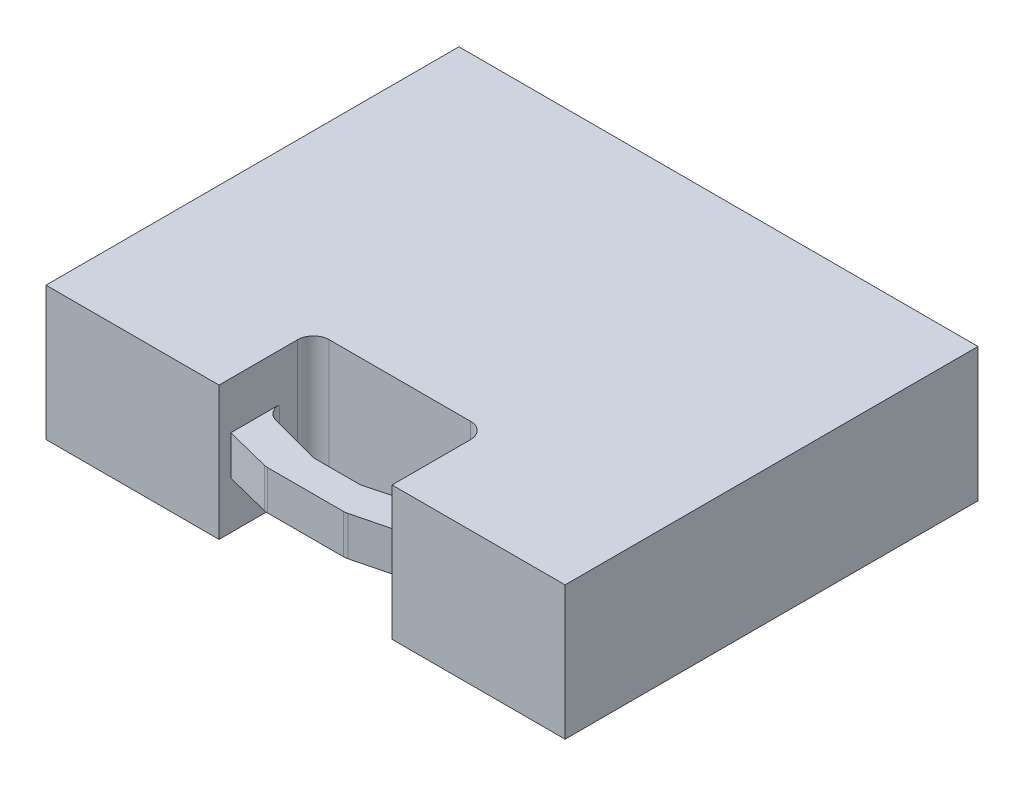
ISO-10303-21;
HEADER;
FILE_DESCRIPTION(('STEP AP214'),'2;1');
FILE_NAME('part.step','',(''),(''),'','','');
FILE_SCHEMA(('AUTOMOTIVE_DESIGN { 1 0 10303 214 1 1 1 1 }'));
ENDSEC;
DATA;
#1=APPLICATION_CONTEXT('core data for automotive mechanical design processes');
#2=APPLICATION_PROTOCOL_DEFINITION('international standard','automotive_design',2000,#1);
#3=PRODUCT_CONTEXT('',#1,'mechanical');
#4=PRODUCT('Part','Part','',(#3));
#5=PRODUCT_RELATED_PRODUCT_CATEGORY('part','',(#4));
#6=PRODUCT_DEFINITION_FORMATION('','',#4);
#7=PRODUCT_DEFINITION_CONTEXT('part definition',#1,'design');
#8=PRODUCT_DEFINITION('design','',#6,#7);
#9=PRODUCT_DEFINITION_SHAPE('','',#8);
#10=(LENGTH_UNIT() NAMED_UNIT(*) SI_UNIT(.MILLI.,.METRE.));
#11=(NAMED_UNIT(*) PLANE_ANGLE_UNIT() SI_UNIT($,.RADIAN.));
#12=(NAMED_UNIT(*) SI_UNIT($,.STERADIAN.) SOLID_ANGLE_UNIT());
#13=UNCERTAINTY_MEASURE_WITH_UNIT(LENGTH_MEASURE(1.E-05),#10,'distance_accuracy_value','');
#14=(GEOMETRIC_REPRESENTATION_CONTEXT(3) GLOBAL_UNCERTAINTY_ASSIGNED_CONTEXT((#13)) GLOBAL_UNIT_ASSIGNED_CONTEXT((#10,
#11,#12)) REPRESENTATION_CONTEXT('',''));
#15=CARTESIAN_POINT('',(0.,0.,0.));
#16=DIRECTION('',(0.,0.,1.));
#17=DIRECTION('',(1.,0.,0.));
#18=AXIS2_PLACEMENT_3D('',#15,#16,#17);
#19=CARTESIAN_POINT('',(-209.55,107.95,166.6875));
#20=DIRECTION('',(0.,0.,-1.));
#21=DIRECTION('',(-1.,0.,0.));
#22=AXIS2_PLACEMENT_3D('',#19,#20,#21);
#23=PLANE('',#22);
#24=DIRECTION('',(-1.,0.,0.));
#25=VECTOR('',#24,1.);
#26=CARTESIAN_POINT('',(-69.85,38.1,166.6875));
#27=LINE('',#26,#25);
#28=CARTESIAN_POINT('',(30.5887182557428,38.1,166.6875));
#29=VERTEX_POINT('',#28);
#30=CARTESIAN_POINT('',(-30.588718255743,38.1,166.6875));
#31=VERTEX_POINT('',#30);
#32=EDGE_CURVE('E660',#29,#31,#27,.T.);
#33=ORIENTED_EDGE('',*,*,#32,.F.);
#34=DIRECTION('',(0.,1.,0.));
#35=VECTOR('',#34,1.);
#36=CARTESIAN_POINT('',(30.5887182557428,107.95,166.6875));
#37=LINE('',#36,#35);
#38=CARTESIAN_POINT('',(30.5887182557428,69.85,166.6875));
#39=VERTEX_POINT('',#38);
#40=EDGE_CURVE('E273',#29,#39,#37,.T.);
#41=ORIENTED_EDGE('',*,*,#40,.T.);
#42=DIRECTION('',(1.,0.,0.));
#43=VECTOR('',#42,1.);
#44=CARTESIAN_POINT('',(-69.85,69.85,166.6875));
#45=LINE('',#44,#43);
#46=CARTESIAN_POINT('',(-30.588718255743,69.85,166.6875));
#47=VERTEX_POINT('',#46);
#48=EDGE_CURVE('E325',#47,#39,#45,.T.);
#49=ORIENTED_EDGE('',*,*,#48,.F.);
#50=DIRECTION('',(0.,1.,0.));
#51=VECTOR('',#50,1.);
#52=CARTESIAN_POINT('',(-30.588718255743,107.95,166.6875));
#53=LINE('',#52,#51);
#54=EDGE_CURVE('E270',#47,#31,#53,.F.);
#55=ORIENTED_EDGE('',*,*,#54,.T.);
#56=EDGE_LOOP('',(#33,#41,#49,#55));
#57=FACE_BOUND('',#56,.T.);
#58=ADVANCED_FACE('F32',(#57),#23,.F.);
#59=CARTESIAN_POINT('',(69.85,0.,157.1625));
#60=DIRECTION('',(-0.245071510184318,0.,-0.969505005090731));
#61=DIRECTION('',(-0.969505005090731,0.,0.245071510184318));
#62=AXIS2_PLACEMENT_3D('',#59,#60,#61);
#63=PLANE('',#62);
#64=DIRECTION('',(-0.969505005090731,0.,0.245071510184318));
#65=VECTOR('',#64,1.);
#66=CARTESIAN_POINT('',(69.85,38.1,157.1625));
#67=LINE('',#66,#65);
#68=CARTESIAN_POINT('',(69.85,38.1,157.1625));
#69=VERTEX_POINT('',#68);
#70=CARTESIAN_POINT('',(33.7011264350836,38.1,166.300213564652));
#71=VERTEX_POINT('',#70);
#72=EDGE_CURVE('E326',#69,#71,#67,.T.);
#73=ORIENTED_EDGE('',*,*,#72,.F.);
#74=DIRECTION('',(0.,1.,0.));
#75=VECTOR('',#74,1.);
#76=CARTESIAN_POINT('',(69.85,0.,157.1625));
#77=LINE('',#76,#75);
#78=CARTESIAN_POINT('',(69.8500000000001,69.85,157.1625));
#79=VERTEX_POINT('',#78);
#80=EDGE_CURVE('E228',#69,#79,#77,.T.);
#81=ORIENTED_EDGE('',*,*,#80,.T.);
#82=DIRECTION('',(-0.969505005090731,0.,0.245071510184318));
#83=VECTOR('',#82,1.);
#84=CARTESIAN_POINT('',(69.85,69.85,157.1625));
#85=LINE('',#84,#83);
#86=CARTESIAN_POINT('',(33.7011264350836,69.85,166.300213564652));
#87=VERTEX_POINT('',#86);
#88=EDGE_CURVE('E231',#79,#87,#85,.T.);
#89=ORIENTED_EDGE('',*,*,#88,.T.);
#90=DIRECTION('',(0.,1.,0.));
#91=VECTOR('',#90,1.);
#92=CARTESIAN_POINT('',(33.7011264350836,0.,166.300213564652));
#93=LINE('',#92,#91);
#94=EDGE_CURVE('E275',#87,#71,#93,.F.);
#95=ORIENTED_EDGE('',*,*,#94,.T.);
#96=EDGE_LOOP('',(#73,#81,#89,#95));
#97=FACE_BOUND('',#96,.T.);
#98=ADVANCED_FACE('F415',(#97),#63,.F.);
#99=CARTESIAN_POINT('',(-69.85,0.,157.1625));
#100=DIRECTION('',(0.245071510184315,0.,-0.969505005090731));
#101=DIRECTION('',(-0.969505005090731,0.,-0.245071510184315));
#102=AXIS2_PLACEMENT_3D('',#99,#100,#101);
#103=PLANE('',#102);
#104=DIRECTION('',(-0.969505005090731,0.,-0.245071510184315));
#105=VECTOR('',#104,1.);
#106=CARTESIAN_POINT('',(-69.85,38.1,157.1625));
#107=LINE('',#106,#105);
#108=CARTESIAN_POINT('',(-33.7011264350838,38.1,166.300213564652));
#109=VERTEX_POINT('',#108);
#110=CARTESIAN_POINT('',(-69.85,38.1,157.1625));
#111=VERTEX_POINT('',#110);
#112=EDGE_CURVE('E192',#109,#111,#107,.T.);
#113=ORIENTED_EDGE('',*,*,#112,.F.);
#114=DIRECTION('',(0.,1.,0.));
#115=VECTOR('',#114,1.);
#116=CARTESIAN_POINT('',(-33.7011264350838,0.,166.300213564652));
#117=LINE('',#116,#115);
#118=CARTESIAN_POINT('',(-33.7011264350838,69.85,166.300213564652));
#119=VERTEX_POINT('',#118);
#120=EDGE_CURVE('E278',#109,#119,#117,.T.);
#121=ORIENTED_EDGE('',*,*,#120,.T.);
#122=DIRECTION('',(-0.969505005090731,0.,-0.245071510184315));
#123=VECTOR('',#122,1.);
#124=CARTESIAN_POINT('',(-69.85,69.85,157.1625));
#125=LINE('',#124,#123);
#126=CARTESIAN_POINT('',(-69.85,69.85,157.1625));
#127=VERTEX_POINT('',#126);
#128=EDGE_CURVE('E215',#119,#127,#125,.T.);
#129=ORIENTED_EDGE('',*,*,#128,.T.);
#130=DIRECTION('',(0.,1.,0.));
#131=VECTOR('',#130,1.);
#132=CARTESIAN_POINT('',(-69.85,0.,157.1625));
#133=LINE('',#132,#131);
#134=EDGE_CURVE('E206',#111,#127,#133,.T.);
#135=ORIENTED_EDGE('',*,*,#134,.F.);
#136=EDGE_LOOP('',(#113,#121,#129,#135));
#137=FACE_BOUND('',#136,.T.);
#138=ADVANCED_FACE('F213',(#137),#103,.F.);
#139=CARTESIAN_POINT('',(-69.85,0.,141.2875));
#140=DIRECTION('',(0.,0.,1.));
#141=DIRECTION('',(1.,0.,0.));
#142=AXIS2_PLACEMENT_3D('',#139,#140,#141);
#143=PLANE('',#142);
#144=DIRECTION('',(1.,0.,0.));
#145=VECTOR('',#144,1.);
#146=CARTESIAN_POINT('',(-69.85,38.1,141.2875));
#147=LINE('',#146,#145);
#148=CARTESIAN_POINT('',(-17.3780132806407,38.1,141.2875));
#149=VERTEX_POINT('',#148);
#150=CARTESIAN_POINT('',(17.3780132806407,38.1,141.2875));
#151=VERTEX_POINT('',#150);
#152=EDGE_CURVE('E649',#149,#151,#147,.T.);
#153=ORIENTED_EDGE('',*,*,#152,.F.);
#154=DIRECTION('',(0.,-1.,0.));
#155=VECTOR('',#154,1.);
#156=CARTESIAN_POINT('',(-17.3780132806407,107.95,141.2875));
#157=LINE('',#156,#155);
#158=CARTESIAN_POINT('',(-17.3780132806407,69.85,141.2875));
#159=VERTEX_POINT('',#158);
#160=EDGE_CURVE('E290',#149,#159,#157,.F.);
#161=ORIENTED_EDGE('',*,*,#160,.T.);
#162=DIRECTION('',(1.,0.,0.));
#163=VECTOR('',#162,1.);
#164=CARTESIAN_POINT('',(-69.85,69.85,141.2875));
#165=LINE('',#164,#163);
#166=CARTESIAN_POINT('',(17.3780132806407,69.85,141.2875));
#167=VERTEX_POINT('',#166);
#168=EDGE_CURVE('E339',#159,#167,#165,.T.);
#169=ORIENTED_EDGE('',*,*,#168,.T.);
#170=DIRECTION('',(0.,1.,0.));
#171=VECTOR('',#170,1.);
#172=CARTESIAN_POINT('',(17.3780132806407,0.,141.2875));
#173=LINE('',#172,#171);
#174=EDGE_CURVE('E292',#167,#151,#173,.F.);
#175=ORIENTED_EDGE('',*,*,#174,.T.);
#176=EDGE_LOOP('',(#153,#161,#169,#175));
#177=FACE_BOUND('',#176,.T.);
#178=ADVANCED_FACE('F437',(#177),#143,.F.);
#179=CARTESIAN_POINT('',(69.85,0.,127.675681024499));
#180=DIRECTION('',(-0.258819045102525,0.,-0.965925826289067));
#181=DIRECTION('',(0.,-1.,0.));
#182=AXIS2_PLACEMENT_3D('',#179,#180,#181);
#183=PLANE('',#182);
#184=DIRECTION('',(-0.965925826289067,0.,0.258819045102525));
#185=VECTOR('',#184,1.);
#186=CARTESIAN_POINT('',(69.85,38.1,127.675681024499));
#187=LINE('',#186,#185);
#188=CARTESIAN_POINT('',(20.6650151534427,38.1,140.854757993871));
#189=VERTEX_POINT('',#188);
#190=CARTESIAN_POINT('',(60.4370018728021,38.1,130.197886271037));
#191=VERTEX_POINT('',#190);
#192=EDGE_CURVE('E667',#189,#191,#187,.F.);
#193=ORIENTED_EDGE('',*,*,#192,.F.);
#194=DIRECTION('',(0.,-1.,0.));
#195=VECTOR('',#194,1.);
#196=CARTESIAN_POINT('',(20.6650151534427,107.95,140.854757993871));
#197=LINE('',#196,#195);
#198=CARTESIAN_POINT('',(20.6650151534427,69.85,140.854757993871));
#199=VERTEX_POINT('',#198);
#200=EDGE_CURVE('E285',#189,#199,#197,.F.);
#201=ORIENTED_EDGE('',*,*,#200,.T.);
#202=DIRECTION('',(-0.965925826289067,0.,0.258819045102525));
#203=VECTOR('',#202,1.);
#204=CARTESIAN_POINT('',(69.85,69.85,127.675681024499));
#205=LINE('',#204,#203);
#206=CARTESIAN_POINT('',(60.4370018728021,69.85,130.197886271037));
#207=VERTEX_POINT('',#206);
#208=EDGE_CURVE('E345',#199,#207,#205,.F.);
#209=ORIENTED_EDGE('',*,*,#208,.T.);
#210=DIRECTION('',(0.,1.,0.));
#211=VECTOR('',#210,1.);
#212=CARTESIAN_POINT('',(60.4370018728021,0.,130.197886271037));
#213=LINE('',#212,#211);
#214=EDGE_CURVE('E287',#207,#191,#213,.F.);
#215=ORIENTED_EDGE('',*,*,#214,.T.);
#216=EDGE_LOOP('',(#193,#201,#209,#215));
#217=FACE_BOUND('',#216,.T.);
#218=ADVANCED_FACE('F433',(#217),#183,.T.);
#219=CARTESIAN_POINT('',(-19.0500000000007,0.,141.2875));
#220=DIRECTION('',(0.258819045102524,0.,-0.965925826289067));
#221=DIRECTION('',(0.,-1.,0.));
#222=AXIS2_PLACEMENT_3D('',#219,#220,#221);
#223=PLANE('',#222);
#224=DIRECTION('',(-0.965925826289068,0.,-0.258819045102524));
#225=VECTOR('',#224,1.);
#226=CARTESIAN_POINT('',(-19.0500000000007,38.1,141.2875));
#227=LINE('',#226,#225);
#228=CARTESIAN_POINT('',(-60.4370018728021,38.1,130.197886271037));
#229=VERTEX_POINT('',#228);
#230=CARTESIAN_POINT('',(-20.6650151534428,38.1,140.854757993871));
#231=VERTEX_POINT('',#230);
#232=EDGE_CURVE('E659',#229,#231,#227,.F.);
#233=ORIENTED_EDGE('',*,*,#232,.F.);
#234=DIRECTION('',(0.,-1.,0.));
#235=VECTOR('',#234,1.);
#236=CARTESIAN_POINT('',(-60.437001872802,107.95,130.197886271037));
#237=LINE('',#236,#235);
#238=CARTESIAN_POINT('',(-60.437001872802,69.85,130.197886271037));
#239=VERTEX_POINT('',#238);
#240=EDGE_CURVE('E54',#229,#239,#237,.F.);
#241=ORIENTED_EDGE('',*,*,#240,.T.);
#242=DIRECTION('',(-0.965925826289068,0.,-0.258819045102524));
#243=VECTOR('',#242,1.);
#244=CARTESIAN_POINT('',(-19.0500000000007,69.85,141.2875));
#245=LINE('',#244,#243);
#246=CARTESIAN_POINT('',(-20.6650151534428,69.85,140.854757993871));
#247=VERTEX_POINT('',#246);
#248=EDGE_CURVE('E324',#239,#247,#245,.F.);
#249=ORIENTED_EDGE('',*,*,#248,.T.);
#250=DIRECTION('',(0.,1.,0.));
#251=VECTOR('',#250,1.);
#252=CARTESIAN_POINT('',(-20.6650151534428,0.,140.854757993871));
#253=LINE('',#252,#251);
#254=EDGE_CURVE('E296',#247,#231,#253,.F.);
#255=ORIENTED_EDGE('',*,*,#254,.T.);
#256=EDGE_LOOP('',(#233,#241,#249,#255));
#257=FACE_BOUND('',#256,.T.);
#258=ADVANCED_FACE('F436',(#257),#223,.T.);
#259=CARTESIAN_POINT('',(30.5887182557428,107.95,153.9875));
#260=DIRECTION('',(0.,1.,0.));
#261=DIRECTION('',(0.,0.,1.));
#262=AXIS2_PLACEMENT_3D('',#259,#260,#261);
#263=CYLINDRICAL_SURFACE('',#262,12.7);
#264=ORIENTED_EDGE('',*,*,#40,.F.);
#265=CARTESIAN_POINT('',(30.5887182557428,38.1,153.9875));
#266=DIRECTION('',(0.,-1.,0.));
#267=DIRECTION('',(0.,0.,-1.));
#268=AXIS2_PLACEMENT_3D('',#265,#266,#267);
#269=CIRCLE('',#268,12.7);
#270=EDGE_CURVE('E199',#29,#71,#269,.F.);
#271=ORIENTED_EDGE('',*,*,#270,.T.);
#272=ORIENTED_EDGE('',*,*,#94,.F.);
#273=CARTESIAN_POINT('',(30.5887182557428,69.85,153.9875));
#274=DIRECTION('',(0.,-1.,0.));
#275=DIRECTION('',(0.,0.,-1.));
#276=AXIS2_PLACEMENT_3D('',#273,#274,#275);
#277=CIRCLE('',#276,12.7);
#278=EDGE_CURVE('E354',#39,#87,#277,.F.);
#279=ORIENTED_EDGE('',*,*,#278,.F.);
#280=EDGE_LOOP('',(#264,#271,#272,#279));
#281=FACE_BOUND('',#280,.T.);
#282=ADVANCED_FACE('F441',(#281),#263,.T.);
#283=CARTESIAN_POINT('',(-30.588718255743,0.,153.9875));
#284=DIRECTION('',(0.,1.,0.));
#285=DIRECTION('',(0.,0.,1.));
#286=AXIS2_PLACEMENT_3D('',#283,#284,#285);
#287=CYLINDRICAL_SURFACE('',#286,12.7);
#288=ORIENTED_EDGE('',*,*,#120,.F.);
#289=CARTESIAN_POINT('',(-30.588718255743,38.1,153.9875));
#290=DIRECTION('',(0.,-1.,0.));
#291=DIRECTION('',(0.,0.,-1.));
#292=AXIS2_PLACEMENT_3D('',#289,#290,#291);
#293=CIRCLE('',#292,12.7);
#294=EDGE_CURVE('E195',#109,#31,#293,.F.);
#295=ORIENTED_EDGE('',*,*,#294,.T.);
#296=ORIENTED_EDGE('',*,*,#54,.F.);
#297=CARTESIAN_POINT('',(-30.588718255743,69.85,153.9875));
#298=DIRECTION('',(0.,-1.,0.));
#299=DIRECTION('',(0.,0.,-1.));
#300=AXIS2_PLACEMENT_3D('',#297,#298,#299);
#301=CIRCLE('',#300,12.7);
#302=EDGE_CURVE('E351',#119,#47,#301,.F.);
#303=ORIENTED_EDGE('',*,*,#302,.F.);
#304=EDGE_LOOP('',(#288,#295,#296,#303));
#305=FACE_BOUND('',#304,.T.);
#306=ADVANCED_FACE('F444',(#305),#287,.T.);
#307=CARTESIAN_POINT('',(57.15,0.,117.930628277166));
#308=DIRECTION('',(0.,1.,0.));
#309=DIRECTION('',(0.,0.,1.));
#310=AXIS2_PLACEMENT_3D('',#307,#308,#309);
#311=CYLINDRICAL_SURFACE('',#310,12.7);
#312=CARTESIAN_POINT('',(57.15,38.1,117.930628277166));
#313=DIRECTION('',(0.,-1.,0.));
#314=DIRECTION('',(0.,0.,-1.));
#315=AXIS2_PLACEMENT_3D('',#312,#313,#314);
#316=CIRCLE('',#315,12.7);
#317=CARTESIAN_POINT('',(69.85,38.1,117.930628277166));
#318=VERTEX_POINT('',#317);
#319=EDGE_CURVE('E669',#191,#318,#316,.F.);
#320=ORIENTED_EDGE('',*,*,#319,.F.);
#321=ORIENTED_EDGE('',*,*,#214,.F.);
#322=CARTESIAN_POINT('',(57.15,69.85,117.930628277166));
#323=DIRECTION('',(0.,-1.,0.));
#324=DIRECTION('',(0.,0.,-1.));
#325=AXIS2_PLACEMENT_3D('',#322,#323,#324);
#326=CIRCLE('',#325,12.7);
#327=CARTESIAN_POINT('',(69.8500000000001,69.85,117.930628277166));
#328=VERTEX_POINT('',#327);
#329=EDGE_CURVE('E348',#207,#328,#326,.F.);
#330=ORIENTED_EDGE('',*,*,#329,.T.);
#331=DIRECTION('',(0.,-1.,0.));
#332=VECTOR('',#331,1.);
#333=CARTESIAN_POINT('',(69.85,107.95,117.930628277166));
#334=LINE('',#333,#332);
#335=EDGE_CURVE('E283',#318,#328,#334,.F.);
#336=ORIENTED_EDGE('',*,*,#335,.F.);
#337=EDGE_LOOP('',(#320,#321,#330,#336));
#338=FACE_BOUND('',#337,.T.);
#339=ADVANCED_FACE('F448',(#338),#311,.F.);
#340=CARTESIAN_POINT('',(17.3780132806407,0.,128.5875));
#341=DIRECTION('',(0.,-1.,0.));
#342=DIRECTION('',(0.,0.,-1.));
#343=AXIS2_PLACEMENT_3D('',#340,#341,#342);
#344=CYLINDRICAL_SURFACE('',#343,12.7);
#345=CARTESIAN_POINT('',(17.3780132806407,38.1,128.5875));
#346=DIRECTION('',(0.,-1.,0.));
#347=DIRECTION('',(0.,0.,-1.));
#348=AXIS2_PLACEMENT_3D('',#345,#346,#347);
#349=CIRCLE('',#348,12.7);
#350=EDGE_CURVE('E654',#151,#189,#349,.F.);
#351=ORIENTED_EDGE('',*,*,#350,.F.);
#352=ORIENTED_EDGE('',*,*,#174,.F.);
#353=CARTESIAN_POINT('',(17.3780132806407,69.85,128.5875));
#354=DIRECTION('',(0.,-1.,0.));
#355=DIRECTION('',(0.,0.,-1.));
#356=AXIS2_PLACEMENT_3D('',#353,#354,#355);
#357=CIRCLE('',#356,12.7);
#358=EDGE_CURVE('E342',#167,#199,#357,.F.);
#359=ORIENTED_EDGE('',*,*,#358,.T.);
#360=ORIENTED_EDGE('',*,*,#200,.F.);
#361=EDGE_LOOP('',(#351,#352,#359,#360));
#362=FACE_BOUND('',#361,.T.);
#363=ADVANCED_FACE('F452',(#362),#344,.F.);
#364=CARTESIAN_POINT('',(-17.3780132806407,0.,128.5875));
#365=DIRECTION('',(0.,1.,0.));
#366=DIRECTION('',(0.,0.,1.));
#367=AXIS2_PLACEMENT_3D('',#364,#365,#366);
#368=CYLINDRICAL_SURFACE('',#367,12.7);
#369=CARTESIAN_POINT('',(-17.3780132806407,38.1,128.5875));
#370=DIRECTION('',(0.,-1.,0.));
#371=DIRECTION('',(0.,0.,-1.));
#372=AXIS2_PLACEMENT_3D('',#369,#370,#371);
#373=CIRCLE('',#372,12.7);
#374=EDGE_CURVE('E655',#231,#149,#373,.F.);
#375=ORIENTED_EDGE('',*,*,#374,.F.);
#376=ORIENTED_EDGE('',*,*,#254,.F.);
#377=CARTESIAN_POINT('',(-17.3780132806407,69.85,128.5875));
#378=DIRECTION('',(0.,-1.,0.));
#379=DIRECTION('',(0.,0.,-1.));
#380=AXIS2_PLACEMENT_3D('',#377,#378,#379);
#381=CIRCLE('',#380,12.7);
#382=EDGE_CURVE('E336',#247,#159,#381,.F.);
#383=ORIENTED_EDGE('',*,*,#382,.T.);
#384=ORIENTED_EDGE('',*,*,#160,.F.);
#385=EDGE_LOOP('',(#375,#376,#383,#384));
#386=FACE_BOUND('',#385,.T.);
#387=ADVANCED_FACE('F456',(#386),#368,.F.);
#388=CARTESIAN_POINT('',(-57.15,0.,117.930628277166));
#389=DIRECTION('',(0.,-1.,0.));
#390=DIRECTION('',(0.,0.,-1.));
#391=AXIS2_PLACEMENT_3D('',#388,#389,#390);
#392=CYLINDRICAL_SURFACE('',#391,12.7);
#393=CARTESIAN_POINT('',(-57.15,38.1,117.930628277166));
#394=DIRECTION('',(0.,-1.,0.));
#395=DIRECTION('',(0.,0.,-1.));
#396=AXIS2_PLACEMENT_3D('',#393,#394,#395);
#397=CIRCLE('',#396,12.7);
#398=CARTESIAN_POINT('',(-69.85,38.1,117.930628277166));
#399=VERTEX_POINT('',#398);
#400=EDGE_CURVE('E11',#399,#229,#397,.F.);
#401=ORIENTED_EDGE('',*,*,#400,.F.);
#402=DIRECTION('',(0.,1.,0.));
#403=VECTOR('',#402,1.);
#404=CARTESIAN_POINT('',(-69.85,0.,117.930628277166));
#405=LINE('',#404,#403);
#406=CARTESIAN_POINT('',(-69.85,69.85,117.930628277166));
#407=VERTEX_POINT('',#406);
#408=EDGE_CURVE('E209',#407,#399,#405,.F.);
#409=ORIENTED_EDGE('',*,*,#408,.F.);
#410=CARTESIAN_POINT('',(-57.15,69.85,117.930628277166));
#411=DIRECTION('',(0.,-1.,0.));
#412=DIRECTION('',(0.,0.,-1.));
#413=AXIS2_PLACEMENT_3D('',#410,#411,#412);
#414=CIRCLE('',#413,12.7);
#415=EDGE_CURVE('E40',#407,#239,#414,.F.);
#416=ORIENTED_EDGE('',*,*,#415,.T.);
#417=ORIENTED_EDGE('',*,*,#240,.F.);
#418=EDGE_LOOP('',(#401,#409,#416,#417));
#419=FACE_BOUND('',#418,.T.);
#420=ADVANCED_FACE('F319',(#419),#392,.F.);
#421=DIRECTION('',(1.,0.,0.));
#422=VECTOR('',#421,1.);
#423=CARTESIAN_POINT('',(-209.55,0.,166.6875));
#424=LINE('',#423,#422);
#425=CARTESIAN_POINT('',(-209.55,0.,166.6875));
#426=VERTEX_POINT('',#425);
#427=CARTESIAN_POINT('',(-69.85,0.,166.6875));
#428=VERTEX_POINT('',#427);
#429=EDGE_CURVE('E239',#426,#428,#424,.T.);
#430=ORIENTED_EDGE('',*,*,#429,.T.);
#431=DIRECTION('',(0.,1.,0.));
#432=VECTOR('',#431,1.);
#433=CARTESIAN_POINT('',(-69.85,0.,166.6875));
#434=LINE('',#433,#432);
#435=CARTESIAN_POINT('',(-69.85,107.95,166.6875));
#436=VERTEX_POINT('',#435);
#437=EDGE_CURVE('E216',#428,#436,#434,.T.);
#438=ORIENTED_EDGE('',*,*,#437,.T.);
#439=DIRECTION('',(1.,0.,0.));
#440=VECTOR('',#439,1.);
#441=CARTESIAN_POINT('',(-209.55,107.95,166.6875));
#442=LINE('',#441,#440);
#443=CARTESIAN_POINT('',(-209.55,107.95,166.6875));
#444=VERTEX_POINT('',#443);
#445=EDGE_CURVE('E244',#444,#436,#442,.T.);
#446=ORIENTED_EDGE('',*,*,#445,.F.);
#447=DIRECTION('',(0.,-1.,0.));
#448=VECTOR('',#447,1.);
#449=CARTESIAN_POINT('',(-209.55,107.95,166.6875));
#450=LINE('',#449,#448);
#451=EDGE_CURVE('E261',#444,#426,#450,.T.);
#452=ORIENTED_EDGE('',*,*,#451,.T.);
#453=EDGE_LOOP('',(#430,#438,#446,#452));
#454=FACE_BOUND('',#453,.T.);
#455=ADVANCED_FACE('F370',(#454),#23,.F.);
#456=CARTESIAN_POINT('',(69.8500000000001,107.95,166.6875));
#457=VERTEX_POINT('',#456);
#458=CARTESIAN_POINT('',(209.55,107.95,166.6875));
#459=VERTEX_POINT('',#458);
#460=EDGE_CURVE('E243',#457,#459,#442,.T.);
#461=ORIENTED_EDGE('',*,*,#460,.F.);
#462=DIRECTION('',(0.,1.,0.));
#463=VECTOR('',#462,1.);
#464=CARTESIAN_POINT('',(69.8500000000001,0.,166.6875));
#465=LINE('',#464,#463);
#466=CARTESIAN_POINT('',(69.8500000000001,0.,166.6875));
#467=VERTEX_POINT('',#466);
#468=EDGE_CURVE('E232',#467,#457,#465,.T.);
#469=ORIENTED_EDGE('',*,*,#468,.F.);
#470=CARTESIAN_POINT('',(209.55,0.,166.6875));
#471=VERTEX_POINT('',#470);
#472=EDGE_CURVE('E256',#467,#471,#424,.T.);
#473=ORIENTED_EDGE('',*,*,#472,.T.);
#474=DIRECTION('',(0.,-1.,0.));
#475=VECTOR('',#474,1.);
#476=CARTESIAN_POINT('',(209.55,107.95,166.6875));
#477=LINE('',#476,#475);
#478=EDGE_CURVE('E247',#459,#471,#477,.T.);
#479=ORIENTED_EDGE('',*,*,#478,.F.);
#480=EDGE_LOOP('',(#461,#469,#473,#479));
#481=FACE_BOUND('',#480,.T.);
#482=ADVANCED_FACE('F393',(#481),#23,.F.);
#483=CARTESIAN_POINT('',(209.55,107.95,166.6875));
#484=DIRECTION('',(-1.,0.,0.));
#485=DIRECTION('',(0.,0.,1.));
#486=AXIS2_PLACEMENT_3D('',#483,#484,#485);
#487=PLANE('',#486);
#488=DIRECTION('',(0.,0.,-1.));
#489=VECTOR('',#488,1.);
#490=CARTESIAN_POINT('',(209.55,0.,166.6875));
#491=LINE('',#490,#489);
#492=CARTESIAN_POINT('',(209.55,0.,-166.6875));
#493=VERTEX_POINT('',#492);
#494=EDGE_CURVE('E248',#471,#493,#491,.T.);
#495=ORIENTED_EDGE('',*,*,#494,.T.);
#496=DIRECTION('',(0.,-1.,0.));
#497=VECTOR('',#496,1.);
#498=CARTESIAN_POINT('',(209.55,107.95,-166.6875));
#499=LINE('',#498,#497);
#500=CARTESIAN_POINT('',(209.55,107.95,-166.6875));
#501=VERTEX_POINT('',#500);
#502=EDGE_CURVE('E267',#501,#493,#499,.T.);
#503=ORIENTED_EDGE('',*,*,#502,.F.);
#504=DIRECTION('',(0.,0.,-1.));
#505=VECTOR('',#504,1.);
#506=CARTESIAN_POINT('',(209.55,107.95,166.6875));
#507=LINE('',#506,#505);
#508=EDGE_CURVE('E235',#459,#501,#507,.T.);
#509=ORIENTED_EDGE('',*,*,#508,.F.);
#510=ORIENTED_EDGE('',*,*,#478,.T.);
#511=EDGE_LOOP('',(#495,#503,#509,#510));
#512=FACE_BOUND('',#511,.T.);
#513=ADVANCED_FACE('F399',(#512),#487,.F.);
#514=CARTESIAN_POINT('',(-209.55,107.95,-166.6875));
#515=DIRECTION('',(0.,0.,1.));
#516=DIRECTION('',(1.,0.,0.));
#517=AXIS2_PLACEMENT_3D('',#514,#515,#516);
#518=PLANE('',#517);
#519=DIRECTION('',(-1.,0.,0.));
#520=VECTOR('',#519,1.);
#521=CARTESIAN_POINT('',(-209.55,0.,-166.6875));
#522=LINE('',#521,#520);
#523=CARTESIAN_POINT('',(-209.55,0.,-166.6875));
#524=VERTEX_POINT('',#523);
#525=EDGE_CURVE('E251',#493,#524,#522,.T.);
#526=ORIENTED_EDGE('',*,*,#525,.T.);
#527=DIRECTION('',(0.,-1.,0.));
#528=VECTOR('',#527,1.);
#529=CARTESIAN_POINT('',(-209.55,107.95,-166.6875));
#530=LINE('',#529,#528);
#531=CARTESIAN_POINT('',(-209.55,107.95,-166.6875));
#532=VERTEX_POINT('',#531);
#533=EDGE_CURVE('E264',#532,#524,#530,.T.);
#534=ORIENTED_EDGE('',*,*,#533,.F.);
#535=DIRECTION('',(-1.,0.,0.));
#536=VECTOR('',#535,1.);
#537=CARTESIAN_POINT('',(-209.55,107.95,-166.6875));
#538=LINE('',#537,#536);
#539=EDGE_CURVE('E238',#501,#532,#538,.T.);
#540=ORIENTED_EDGE('',*,*,#539,.F.);
#541=ORIENTED_EDGE('',*,*,#502,.T.);
#542=EDGE_LOOP('',(#526,#534,#540,#541));
#543=FACE_BOUND('',#542,.T.);
#544=ADVANCED_FACE('F402',(#543),#518,.F.);
#545=CARTESIAN_POINT('',(-209.55,107.95,166.6875));
#546=DIRECTION('',(1.,0.,0.));
#547=DIRECTION('',(0.,0.,-1.));
#548=AXIS2_PLACEMENT_3D('',#545,#546,#547);
#549=PLANE('',#548);
#550=DIRECTION('',(0.,0.,1.));
#551=VECTOR('',#550,1.);
#552=CARTESIAN_POINT('',(-209.55,0.,166.6875));
#553=LINE('',#552,#551);
#554=EDGE_CURVE('E254',#524,#426,#553,.T.);
#555=ORIENTED_EDGE('',*,*,#554,.T.);
#556=ORIENTED_EDGE('',*,*,#451,.F.);
#557=DIRECTION('',(0.,0.,1.));
#558=VECTOR('',#557,1.);
#559=CARTESIAN_POINT('',(-209.55,107.95,166.6875));
#560=LINE('',#559,#558);
#561=EDGE_CURVE('E241',#532,#444,#560,.T.);
#562=ORIENTED_EDGE('',*,*,#561,.F.);
#563=ORIENTED_EDGE('',*,*,#533,.T.);
#564=EDGE_LOOP('',(#555,#556,#562,#563));
#565=FACE_BOUND('',#564,.T.);
#566=ADVANCED_FACE('F404',(#565),#549,.F.);
#567=CARTESIAN_POINT('',(0.,107.95,0.));
#568=DIRECTION('',(0.,-1.,0.));
#569=DIRECTION('',(0.,0.,-1.));
#570=AXIS2_PLACEMENT_3D('',#567,#568,#569);
#571=PLANE('',#570);
#572=DIRECTION('',(0.,0.,1.));
#573=VECTOR('',#572,1.);
#574=CARTESIAN_POINT('',(-69.85,107.95,166.6875));
#575=LINE('',#574,#573);
#576=CARTESIAN_POINT('',(-69.85,107.95,103.1875));
#577=VERTEX_POINT('',#576);
#578=EDGE_CURVE('E222',#577,#436,#575,.T.);
#579=ORIENTED_EDGE('',*,*,#578,.F.);
#580=CARTESIAN_POINT('',(-57.15,107.95,103.1875));
#581=DIRECTION('',(0.,-1.,0.));
#582=DIRECTION('',(0.,0.,-1.));
#583=AXIS2_PLACEMENT_3D('',#580,#581,#582);
#584=CIRCLE('',#583,12.7);
#585=CARTESIAN_POINT('',(-57.15,107.95,90.4875));
#586=VERTEX_POINT('',#585);
#587=EDGE_CURVE('E313',#577,#586,#584,.T.);
#588=ORIENTED_EDGE('',*,*,#587,.T.);
#589=DIRECTION('',(-1.,0.,0.));
#590=VECTOR('',#589,1.);
#591=CARTESIAN_POINT('',(-69.85,107.95,90.4875));
#592=LINE('',#591,#590);
#593=CARTESIAN_POINT('',(57.15,107.95,90.4875));
#594=VERTEX_POINT('',#593);
#595=EDGE_CURVE('E219',#594,#586,#592,.T.);
#596=ORIENTED_EDGE('',*,*,#595,.F.);
#597=CARTESIAN_POINT('',(57.15,107.95,103.1875));
#598=DIRECTION('',(0.,-1.,0.));
#599=DIRECTION('',(0.,0.,-1.));
#600=AXIS2_PLACEMENT_3D('',#597,#598,#599);
#601=CIRCLE('',#600,12.7);
#602=CARTESIAN_POINT('',(69.85,107.95,103.1875));
#603=VERTEX_POINT('',#602);
#604=EDGE_CURVE('E308',#594,#603,#601,.T.);
#605=ORIENTED_EDGE('',*,*,#604,.T.);
#606=DIRECTION('',(0.,0.,-1.));
#607=VECTOR('',#606,1.);
#608=CARTESIAN_POINT('',(69.8500000000001,107.95,166.6875));
#609=LINE('',#608,#607);
#610=EDGE_CURVE('E229',#457,#603,#609,.T.);
#611=ORIENTED_EDGE('',*,*,#610,.F.);
#612=ORIENTED_EDGE('',*,*,#460,.T.);
#613=ORIENTED_EDGE('',*,*,#508,.T.);
#614=ORIENTED_EDGE('',*,*,#539,.T.);
#615=ORIENTED_EDGE('',*,*,#561,.T.);
#616=ORIENTED_EDGE('',*,*,#445,.T.);
#617=EDGE_LOOP('',(#579,#588,#596,#605,#611,#612,#613,#614,#615,#616));
#618=FACE_BOUND('',#617,.T.);
#619=ADVANCED_FACE('F366',(#618),#571,.F.);
#620=CARTESIAN_POINT('',(0.,0.,0.));
#621=DIRECTION('',(0.,-1.,0.));
#622=DIRECTION('',(0.,0.,-1.));
#623=AXIS2_PLACEMENT_3D('',#620,#621,#622);
#624=PLANE('',#623);
#625=CARTESIAN_POINT('',(-57.15,0.,103.1875));
#626=DIRECTION('',(0.,-1.,0.));
#627=DIRECTION('',(0.,0.,-1.));
#628=AXIS2_PLACEMENT_3D('',#625,#626,#627);
#629=CIRCLE('',#628,12.7);
#630=CARTESIAN_POINT('',(-57.15,0.,90.4875));
#631=VERTEX_POINT('',#630);
#632=CARTESIAN_POINT('',(-69.85,0.,103.1875));
#633=VERTEX_POINT('',#632);
#634=EDGE_CURVE('E315',#631,#633,#629,.F.);
#635=ORIENTED_EDGE('',*,*,#634,.T.);
#636=DIRECTION('',(0.,0.,1.));
#637=VECTOR('',#636,1.);
#638=CARTESIAN_POINT('',(-69.85,0.,166.6875));
#639=LINE('',#638,#637);
#640=EDGE_CURVE('E217',#633,#428,#639,.T.);
#641=ORIENTED_EDGE('',*,*,#640,.T.);
#642=ORIENTED_EDGE('',*,*,#429,.F.);
#643=ORIENTED_EDGE('',*,*,#554,.F.);
#644=ORIENTED_EDGE('',*,*,#525,.F.);
#645=ORIENTED_EDGE('',*,*,#494,.F.);
#646=ORIENTED_EDGE('',*,*,#472,.F.);
#647=DIRECTION('',(0.,0.,-1.));
#648=VECTOR('',#647,1.);
#649=CARTESIAN_POINT('',(69.8500000000001,0.,166.6875));
#650=LINE('',#649,#648);
#651=CARTESIAN_POINT('',(69.85,0.,103.1875));
#652=VERTEX_POINT('',#651);
#653=EDGE_CURVE('E226',#467,#652,#650,.T.);
#654=ORIENTED_EDGE('',*,*,#653,.T.);
#655=CARTESIAN_POINT('',(57.15,0.,103.1875));
#656=DIRECTION('',(0.,-1.,0.));
#657=DIRECTION('',(0.,0.,-1.));
#658=AXIS2_PLACEMENT_3D('',#655,#656,#657);
#659=CIRCLE('',#658,12.7);
#660=CARTESIAN_POINT('',(57.15,0.,90.4875));
#661=VERTEX_POINT('',#660);
#662=EDGE_CURVE('E311',#652,#661,#659,.F.);
#663=ORIENTED_EDGE('',*,*,#662,.T.);
#664=DIRECTION('',(-1.,0.,0.));
#665=VECTOR('',#664,1.);
#666=CARTESIAN_POINT('',(-69.85,0.,90.4875));
#667=LINE('',#666,#665);
#668=EDGE_CURVE('E252',#661,#631,#667,.T.);
#669=ORIENTED_EDGE('',*,*,#668,.T.);
#670=EDGE_LOOP('',(#635,#641,#642,#643,#644,#645,#646,#654,#663,#669));
#671=FACE_BOUND('',#670,.T.);
#672=ADVANCED_FACE('F374',(#671),#624,.T.);
#673=CARTESIAN_POINT('',(69.85,0.,141.2875));
#674=DIRECTION('',(1.,0.,0.));
#675=DIRECTION('',(0.,0.,-1.));
#676=AXIS2_PLACEMENT_3D('',#673,#674,#675);
#677=PLANE('',#676);
#678=ORIENTED_EDGE('',*,*,#80,.F.);
#679=DIRECTION('',(0.,0.,1.));
#680=VECTOR('',#679,1.);
#681=CARTESIAN_POINT('',(69.85,38.1,166.6875));
#682=LINE('',#681,#680);
#683=EDGE_CURVE('E210',#318,#69,#682,.T.);
#684=ORIENTED_EDGE('',*,*,#683,.F.);
#685=ORIENTED_EDGE('',*,*,#335,.T.);
#686=DIRECTION('',(0.,0.,-1.));
#687=VECTOR('',#686,1.);
#688=CARTESIAN_POINT('',(69.8500000000001,69.85,166.6875));
#689=LINE('',#688,#687);
#690=EDGE_CURVE('E329',#79,#328,#689,.T.);
#691=ORIENTED_EDGE('',*,*,#690,.F.);
#692=EDGE_LOOP('',(#678,#684,#685,#691));
#693=FACE_BOUND('',#692,.T.);
#694=ORIENTED_EDGE('',*,*,#468,.T.);
#695=ORIENTED_EDGE('',*,*,#610,.T.);
#696=DIRECTION('',(0.,1.,0.));
#697=VECTOR('',#696,1.);
#698=CARTESIAN_POINT('',(69.85,0.,103.1875));
#699=LINE('',#698,#697);
#700=EDGE_CURVE('E280',#603,#652,#699,.F.);
#701=ORIENTED_EDGE('',*,*,#700,.T.);
#702=ORIENTED_EDGE('',*,*,#653,.F.);
#703=EDGE_LOOP('',(#694,#695,#701,#702));
#704=FACE_BOUND('',#703,.T.);
#705=ADVANCED_FACE('F471',(#693,#704),#677,.F.);
#706=CARTESIAN_POINT('',(-69.85,0.,141.2875));
#707=DIRECTION('',(-1.,0.,0.));
#708=DIRECTION('',(0.,0.,1.));
#709=AXIS2_PLACEMENT_3D('',#706,#707,#708);
#710=PLANE('',#709);
#711=DIRECTION('',(0.,0.,-1.));
#712=VECTOR('',#711,1.);
#713=CARTESIAN_POINT('',(-69.85,38.1,166.6875));
#714=LINE('',#713,#712);
#715=EDGE_CURVE('E46',#111,#399,#714,.T.);
#716=ORIENTED_EDGE('',*,*,#715,.F.);
#717=ORIENTED_EDGE('',*,*,#134,.T.);
#718=DIRECTION('',(0.,0.,1.));
#719=VECTOR('',#718,1.);
#720=CARTESIAN_POINT('',(-69.85,69.85,166.6875));
#721=LINE('',#720,#719);
#722=EDGE_CURVE('E323',#407,#127,#721,.T.);
#723=ORIENTED_EDGE('',*,*,#722,.F.);
#724=ORIENTED_EDGE('',*,*,#408,.T.);
#725=EDGE_LOOP('',(#716,#717,#723,#724));
#726=FACE_BOUND('',#725,.T.);
#727=ORIENTED_EDGE('',*,*,#640,.F.);
#728=DIRECTION('',(0.,1.,0.));
#729=VECTOR('',#728,1.);
#730=CARTESIAN_POINT('',(-69.85,107.95,103.1875));
#731=LINE('',#730,#729);
#732=EDGE_CURVE('E299',#633,#577,#731,.T.);
#733=ORIENTED_EDGE('',*,*,#732,.T.);
#734=ORIENTED_EDGE('',*,*,#578,.T.);
#735=ORIENTED_EDGE('',*,*,#437,.F.);
#736=EDGE_LOOP('',(#727,#733,#734,#735));
#737=FACE_BOUND('',#736,.T.);
#738=ADVANCED_FACE('F203',(#726,#737),#710,.F.);
#739=CARTESIAN_POINT('',(-69.85,0.,90.4875));
#740=DIRECTION('',(0.,0.,-1.));
#741=DIRECTION('',(-1.,0.,0.));
#742=AXIS2_PLACEMENT_3D('',#739,#740,#741);
#743=PLANE('',#742);
#744=ORIENTED_EDGE('',*,*,#668,.F.);
#745=DIRECTION('',(0.,1.,0.));
#746=VECTOR('',#745,1.);
#747=CARTESIAN_POINT('',(57.15,107.95,90.4875));
#748=LINE('',#747,#746);
#749=EDGE_CURVE('E305',#661,#594,#748,.T.);
#750=ORIENTED_EDGE('',*,*,#749,.T.);
#751=ORIENTED_EDGE('',*,*,#595,.T.);
#752=DIRECTION('',(0.,1.,0.));
#753=VECTOR('',#752,1.);
#754=CARTESIAN_POINT('',(-57.15,0.,90.4875));
#755=LINE('',#754,#753);
#756=EDGE_CURVE('E303',#586,#631,#755,.F.);
#757=ORIENTED_EDGE('',*,*,#756,.T.);
#758=EDGE_LOOP('',(#744,#750,#751,#757));
#759=FACE_BOUND('',#758,.T.);
#760=ADVANCED_FACE('F381',(#759),#743,.F.);
#761=CARTESIAN_POINT('',(57.15,0.,103.1875));
#762=DIRECTION('',(0.,-1.,0.));
#763=DIRECTION('',(0.,0.,-1.));
#764=AXIS2_PLACEMENT_3D('',#761,#762,#763);
#765=CYLINDRICAL_SURFACE('',#764,12.7);
#766=ORIENTED_EDGE('',*,*,#662,.F.);
#767=ORIENTED_EDGE('',*,*,#700,.F.);
#768=ORIENTED_EDGE('',*,*,#604,.F.);
#769=ORIENTED_EDGE('',*,*,#749,.F.);
#770=EDGE_LOOP('',(#766,#767,#768,#769));
#771=FACE_BOUND('',#770,.T.);
#772=ADVANCED_FACE('F385',(#771),#765,.F.);
#773=CARTESIAN_POINT('',(-57.15,0.,103.1875));
#774=DIRECTION('',(0.,-1.,0.));
#775=DIRECTION('',(0.,0.,-1.));
#776=AXIS2_PLACEMENT_3D('',#773,#774,#775);
#777=CYLINDRICAL_SURFACE('',#776,12.7);
#778=ORIENTED_EDGE('',*,*,#634,.F.);
#779=ORIENTED_EDGE('',*,*,#756,.F.);
#780=ORIENTED_EDGE('',*,*,#587,.F.);
#781=ORIENTED_EDGE('',*,*,#732,.F.);
#782=EDGE_LOOP('',(#778,#779,#780,#781));
#783=FACE_BOUND('',#782,.T.);
#784=ADVANCED_FACE('F34',(#783),#777,.F.);
#785=CARTESIAN_POINT('',(0.,69.85,0.));
#786=DIRECTION('',(0.,-1.,0.));
#787=DIRECTION('',(0.,0.,-1.));
#788=AXIS2_PLACEMENT_3D('',#785,#786,#787);
#789=PLANE('',#788);
#790=ORIENTED_EDGE('',*,*,#690,.T.);
#791=ORIENTED_EDGE('',*,*,#329,.F.);
#792=ORIENTED_EDGE('',*,*,#208,.F.);
#793=ORIENTED_EDGE('',*,*,#358,.F.);
#794=ORIENTED_EDGE('',*,*,#168,.F.);
#795=ORIENTED_EDGE('',*,*,#382,.F.);
#796=ORIENTED_EDGE('',*,*,#248,.F.);
#797=ORIENTED_EDGE('',*,*,#415,.F.);
#798=ORIENTED_EDGE('',*,*,#722,.T.);
#799=ORIENTED_EDGE('',*,*,#128,.F.);
#800=ORIENTED_EDGE('',*,*,#302,.T.);
#801=ORIENTED_EDGE('',*,*,#48,.T.);
#802=ORIENTED_EDGE('',*,*,#278,.T.);
#803=ORIENTED_EDGE('',*,*,#88,.F.);
#804=EDGE_LOOP('',(#790,#791,#792,#793,#794,#795,#796,#797,#798,#799,#800,#801,#802,#803));
#805=FACE_BOUND('',#804,.T.);
#806=ADVANCED_FACE('F322',(#805),#789,.F.);
#807=CARTESIAN_POINT('',(0.,38.1,0.));
#808=DIRECTION('',(0.,-1.,0.));
#809=DIRECTION('',(0.,0.,-1.));
#810=AXIS2_PLACEMENT_3D('',#807,#808,#809);
#811=PLANE('',#810);
#812=ORIENTED_EDGE('',*,*,#72,.T.);
#813=ORIENTED_EDGE('',*,*,#270,.F.);
#814=ORIENTED_EDGE('',*,*,#32,.T.);
#815=ORIENTED_EDGE('',*,*,#294,.F.);
#816=ORIENTED_EDGE('',*,*,#112,.T.);
#817=ORIENTED_EDGE('',*,*,#715,.T.);
#818=ORIENTED_EDGE('',*,*,#400,.T.);
#819=ORIENTED_EDGE('',*,*,#232,.T.);
#820=ORIENTED_EDGE('',*,*,#374,.T.);
#821=ORIENTED_EDGE('',*,*,#152,.T.);
#822=ORIENTED_EDGE('',*,*,#350,.T.);
#823=ORIENTED_EDGE('',*,*,#192,.T.);
#824=ORIENTED_EDGE('',*,*,#319,.T.);
#825=ORIENTED_EDGE('',*,*,#683,.T.);
#826=EDGE_LOOP('',(#812,#813,#814,#815,#816,#817,#818,#819,#820,#821,#822,#823,#824,#825));
#827=FACE_BOUND('',#826,.T.);
#828=ADVANCED_FACE('F193',(#827),#811,.T.);
#829=CLOSED_SHELL('',(#58,#98,#138,#178,#218,#258,#282,#306,#339,#363,#387,#420,#455,#482,#513,
#544,#566,#619,#672,#705,#738,#760,#772,#784,#806,#828));
#830=MANIFOLD_SOLID_BREP('B2',#829);
#831=ADVANCED_BREP_SHAPE_REPRESENTATION('',(#18,#830),#14);
#832=SHAPE_DEFINITION_REPRESENTATION(#9,#831);
ENDSEC;
END-ISO-10303-21;
